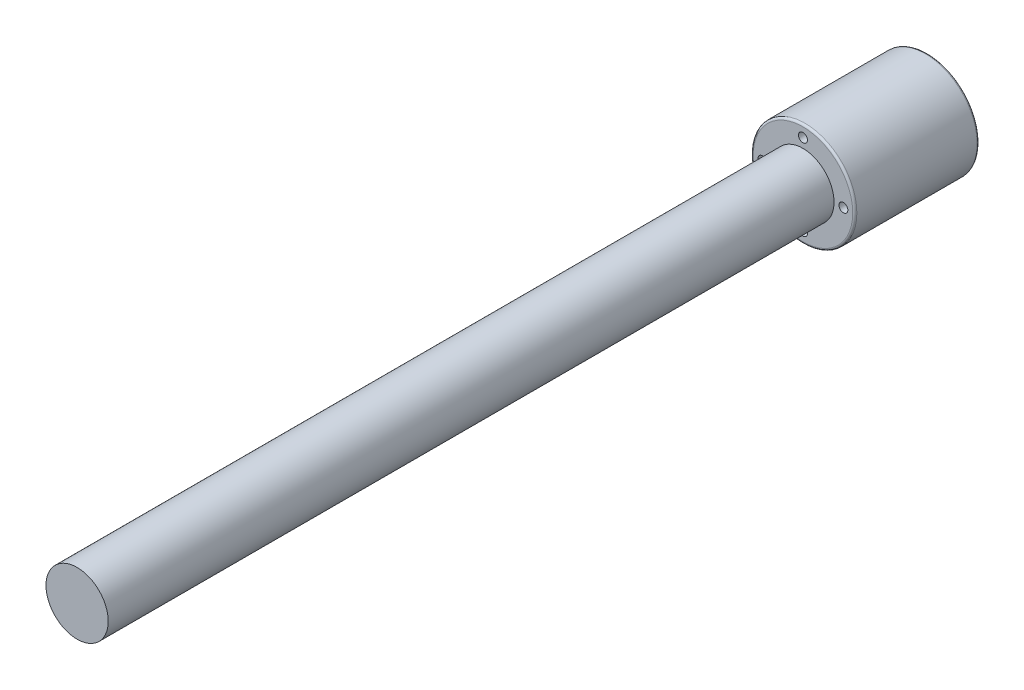
ISO-10303-21;
HEADER;
FILE_DESCRIPTION(('STEP AP214'),'2;1');
FILE_NAME('part.step','',(''),(''),'','','');
FILE_SCHEMA(('AUTOMOTIVE_DESIGN { 1 0 10303 214 1 1 1 1 }'));
ENDSEC;
DATA;
#1=APPLICATION_CONTEXT('core data for automotive mechanical design processes');
#2=APPLICATION_PROTOCOL_DEFINITION('international standard','automotive_design',2000,#1);
#3=PRODUCT_CONTEXT('',#1,'mechanical');
#4=PRODUCT('Part','Part','',(#3));
#5=PRODUCT_RELATED_PRODUCT_CATEGORY('part','',(#4));
#6=PRODUCT_DEFINITION_FORMATION('','',#4);
#7=PRODUCT_DEFINITION_CONTEXT('part definition',#1,'design');
#8=PRODUCT_DEFINITION('design','',#6,#7);
#9=PRODUCT_DEFINITION_SHAPE('','',#8);
#10=(LENGTH_UNIT() NAMED_UNIT(*) SI_UNIT(.MILLI.,.METRE.));
#11=(NAMED_UNIT(*) PLANE_ANGLE_UNIT() SI_UNIT($,.RADIAN.));
#12=(NAMED_UNIT(*) SI_UNIT($,.STERADIAN.) SOLID_ANGLE_UNIT());
#13=UNCERTAINTY_MEASURE_WITH_UNIT(LENGTH_MEASURE(1.E-05),#10,'distance_accuracy_value','');
#14=(GEOMETRIC_REPRESENTATION_CONTEXT(3) GLOBAL_UNCERTAINTY_ASSIGNED_CONTEXT((#13)) GLOBAL_UNIT_ASSIGNED_CONTEXT((#10,
#11,#12)) REPRESENTATION_CONTEXT('',''));
#15=CARTESIAN_POINT('',(0.,0.,0.));
#16=DIRECTION('',(0.,0.,1.));
#17=DIRECTION('',(1.,0.,0.));
#18=AXIS2_PLACEMENT_3D('',#15,#16,#17);
#19=CARTESIAN_POINT('',(0.,0.,0.));
#20=DIRECTION('',(0.,0.,1.));
#21=DIRECTION('',(1.,0.,0.));
#22=AXIS2_PLACEMENT_3D('',#19,#20,#21);
#23=PLANE('',#22);
#24=CARTESIAN_POINT('',(0.,0.,0.));
#25=DIRECTION('',(0.,0.,1.));
#26=DIRECTION('',(1.,0.,0.));
#27=AXIS2_PLACEMENT_3D('',#24,#25,#26);
#28=CIRCLE('',#27,15.);
#29=CARTESIAN_POINT('',(-15.,0.,0.));
#30=VERTEX_POINT('',#29);
#31=EDGE_CURVE('E10',#30,#30,#28,.T.);
#32=ORIENTED_EDGE('',*,*,#31,.T.);
#33=EDGE_LOOP('',(#32));
#34=FACE_BOUND('',#33,.T.);
#35=ADVANCED_FACE('F15',(#34),#23,.T.);
#36=CARTESIAN_POINT('',(0.,0.,0.));
#37=DIRECTION('',(0.,0.,-1.));
#38=DIRECTION('',(1.,0.,0.));
#39=AXIS2_PLACEMENT_3D('',#36,#37,#38);
#40=CYLINDRICAL_SURFACE('',#39,15.);
#41=CARTESIAN_POINT('',(0.,0.,-350.));
#42=DIRECTION('',(0.,0.,1.));
#43=DIRECTION('',(1.,0.,0.));
#44=AXIS2_PLACEMENT_3D('',#41,#42,#43);
#45=CIRCLE('',#44,15.);
#46=CARTESIAN_POINT('',(-15.,0.,-350.));
#47=VERTEX_POINT('',#46);
#48=EDGE_CURVE('E203',#47,#47,#45,.T.);
#49=ORIENTED_EDGE('',*,*,#48,.T.);
#50=DIRECTION('',(0.,0.,1.));
#51=VECTOR('',#50,1.);
#52=CARTESIAN_POINT('',(-15.,0.,0.));
#53=LINE('',#52,#51);
#54=EDGE_CURVE('E24',#47,#30,#53,.T.);
#55=ORIENTED_EDGE('',*,*,#54,.T.);
#56=ORIENTED_EDGE('',*,*,#31,.F.);
#57=ORIENTED_EDGE('',*,*,#54,.F.);
#58=EDGE_LOOP('',(#49,#55,#56,#57));
#59=FACE_BOUND('',#58,.T.);
#60=ADVANCED_FACE('F342',(#59),#40,.T.);
#61=CARTESIAN_POINT('',(0.,0.,-10.));
#62=DIRECTION('',(0.,0.,1.));
#63=DIRECTION('',(1.,0.,0.));
#64=AXIS2_PLACEMENT_3D('',#61,#62,#63);
#65=PLANE('',#64);
#66=CARTESIAN_POINT('',(0.,0.,-10.));
#67=DIRECTION('',(0.,0.,1.));
#68=DIRECTION('',(1.,0.,0.));
#69=AXIS2_PLACEMENT_3D('',#66,#67,#68);
#70=CIRCLE('',#69,5.);
#71=CARTESIAN_POINT('',(-5.,0.,-10.));
#72=VERTEX_POINT('',#71);
#73=EDGE_CURVE('E151',#72,#72,#70,.T.);
#74=ORIENTED_EDGE('',*,*,#73,.F.);
#75=EDGE_LOOP('',(#74));
#76=FACE_BOUND('',#75,.T.);
#77=ADVANCED_FACE('F17',(#76),#65,.F.);
#78=CARTESIAN_POINT('',(0.,0.,0.));
#79=DIRECTION('',(0.,0.,-1.));
#80=DIRECTION('',(1.,0.,0.));
#81=AXIS2_PLACEMENT_3D('',#78,#79,#80);
#82=CYLINDRICAL_SURFACE('',#81,5.);
#83=ORIENTED_EDGE('',*,*,#73,.T.);
#84=DIRECTION('',(0.,0.,-1.));
#85=VECTOR('',#84,1.);
#86=CARTESIAN_POINT('',(-5.,0.,0.));
#87=LINE('',#86,#85);
#88=CARTESIAN_POINT('',(-5.,0.,-360.));
#89=VERTEX_POINT('',#88);
#90=EDGE_CURVE('E41',#72,#89,#87,.T.);
#91=ORIENTED_EDGE('',*,*,#90,.T.);
#92=CARTESIAN_POINT('',(0.,0.,-360.));
#93=DIRECTION('',(0.,0.,1.));
#94=DIRECTION('',(1.,0.,0.));
#95=AXIS2_PLACEMENT_3D('',#92,#93,#94);
#96=CIRCLE('',#95,5.);
#97=EDGE_CURVE('E144',#89,#89,#96,.T.);
#98=ORIENTED_EDGE('',*,*,#97,.F.);
#99=ORIENTED_EDGE('',*,*,#90,.F.);
#100=EDGE_LOOP('',(#83,#91,#98,#99));
#101=FACE_BOUND('',#100,.T.);
#102=ADVANCED_FACE('F341',(#101),#82,.F.);
#103=CARTESIAN_POINT('',(0.,0.,-350.));
#104=DIRECTION('',(0.,0.,-1.));
#105=DIRECTION('',(-1.,0.,0.));
#106=AXIS2_PLACEMENT_3D('',#103,#104,#105);
#107=CYLINDRICAL_SURFACE('',#106,15.);
#108=CARTESIAN_POINT('',(0.,0.,-360.));
#109=DIRECTION('',(0.,0.,-1.));
#110=DIRECTION('',(-1.,0.,0.));
#111=AXIS2_PLACEMENT_3D('',#108,#109,#110);
#112=CIRCLE('',#111,15.);
#113=CARTESIAN_POINT('',(15.,0.,-360.));
#114=VERTEX_POINT('',#113);
#115=EDGE_CURVE('E140',#114,#114,#112,.T.);
#116=ORIENTED_EDGE('',*,*,#115,.F.);
#117=DIRECTION('',(0.,0.,-1.));
#118=VECTOR('',#117,1.);
#119=CARTESIAN_POINT('',(15.,0.,-350.));
#120=LINE('',#119,#118);
#121=CARTESIAN_POINT('',(15.,0.,-410.));
#122=VERTEX_POINT('',#121);
#123=EDGE_CURVE('E148',#114,#122,#120,.T.);
#124=ORIENTED_EDGE('',*,*,#123,.T.);
#125=CARTESIAN_POINT('',(0.,0.,-410.));
#126=DIRECTION('',(0.,0.,1.));
#127=DIRECTION('',(-1.,0.,0.));
#128=AXIS2_PLACEMENT_3D('',#125,#126,#127);
#129=CIRCLE('',#128,15.);
#130=EDGE_CURVE('E178',#122,#122,#129,.T.);
#131=ORIENTED_EDGE('',*,*,#130,.F.);
#132=ORIENTED_EDGE('',*,*,#123,.F.);
#133=EDGE_LOOP('',(#116,#124,#131,#132));
#134=FACE_BOUND('',#133,.T.);
#135=ADVANCED_FACE('F356',(#134),#107,.F.);
#136=CARTESIAN_POINT('',(0.,0.,-360.));
#137=DIRECTION('',(0.,0.,-1.));
#138=DIRECTION('',(0.,-1.,0.));
#139=AXIS2_PLACEMENT_3D('',#136,#137,#138);
#140=PLANE('',#139);
#141=ORIENTED_EDGE('',*,*,#97,.T.);
#142=EDGE_LOOP('',(#141));
#143=FACE_BOUND('',#142,.T.);
#144=ORIENTED_EDGE('',*,*,#115,.T.);
#145=EDGE_LOOP('',(#144));
#146=FACE_BOUND('',#145,.T.);
#147=ADVANCED_FACE('F364',(#143,#146),#140,.T.);
#148=CARTESIAN_POINT('',(0.,19.5,6.05288125429439));
#149=DIRECTION('',(0.,0.,-1.));
#150=DIRECTION('',(-1.,0.,0.));
#151=AXIS2_PLACEMENT_3D('',#148,#149,#150);
#152=CYLINDRICAL_SURFACE('',#151,2.15);
#153=CARTESIAN_POINT('',(0.,19.5,-410.));
#154=DIRECTION('',(0.,0.,1.));
#155=DIRECTION('',(-1.,0.,0.));
#156=AXIS2_PLACEMENT_3D('',#153,#154,#155);
#157=CIRCLE('',#156,2.15);
#158=CARTESIAN_POINT('',(2.15,19.5,-410.));
#159=VERTEX_POINT('',#158);
#160=EDGE_CURVE('E182',#159,#159,#157,.T.);
#161=ORIENTED_EDGE('',*,*,#160,.F.);
#162=DIRECTION('',(0.,0.,1.));
#163=VECTOR('',#162,1.);
#164=CARTESIAN_POINT('',(2.15,19.5,6.05288125429439));
#165=LINE('',#164,#163);
#166=CARTESIAN_POINT('',(2.15,19.5,-350.));
#167=VERTEX_POINT('',#166);
#168=EDGE_CURVE('E137',#159,#167,#165,.T.);
#169=ORIENTED_EDGE('',*,*,#168,.T.);
#170=CARTESIAN_POINT('',(0.,19.5,-350.));
#171=DIRECTION('',(0.,0.,-1.));
#172=DIRECTION('',(-1.,0.,0.));
#173=AXIS2_PLACEMENT_3D('',#170,#171,#172);
#174=CIRCLE('',#173,2.15);
#175=EDGE_CURVE('E205',#167,#167,#174,.T.);
#176=ORIENTED_EDGE('',*,*,#175,.F.);
#177=ORIENTED_EDGE('',*,*,#168,.F.);
#178=EDGE_LOOP('',(#161,#169,#176,#177));
#179=FACE_BOUND('',#178,.T.);
#180=ADVANCED_FACE('F370',(#179),#152,.F.);
#181=CARTESIAN_POINT('',(19.5,0.,6.05288125429439));
#182=DIRECTION('',(0.,0.,-1.));
#183=DIRECTION('',(-1.,0.,0.));
#184=AXIS2_PLACEMENT_3D('',#181,#182,#183);
#185=CYLINDRICAL_SURFACE('',#184,2.15);
#186=CARTESIAN_POINT('',(19.5,0.,-410.));
#187=DIRECTION('',(0.,0.,1.));
#188=DIRECTION('',(-1.,0.,0.));
#189=AXIS2_PLACEMENT_3D('',#186,#187,#188);
#190=CIRCLE('',#189,2.15);
#191=CARTESIAN_POINT('',(21.65,0.,-410.));
#192=VERTEX_POINT('',#191);
#193=EDGE_CURVE('E183',#192,#192,#190,.T.);
#194=ORIENTED_EDGE('',*,*,#193,.F.);
#195=DIRECTION('',(0.,0.,1.));
#196=VECTOR('',#195,1.);
#197=CARTESIAN_POINT('',(21.65,0.,6.05288125429439));
#198=LINE('',#197,#196);
#199=CARTESIAN_POINT('',(21.65,0.,-350.));
#200=VERTEX_POINT('',#199);
#201=EDGE_CURVE('E134',#192,#200,#198,.T.);
#202=ORIENTED_EDGE('',*,*,#201,.T.);
#203=CARTESIAN_POINT('',(19.5,0.,-350.));
#204=DIRECTION('',(0.,0.,-1.));
#205=DIRECTION('',(-1.,0.,0.));
#206=AXIS2_PLACEMENT_3D('',#203,#204,#205);
#207=CIRCLE('',#206,2.15);
#208=EDGE_CURVE('E127',#200,#200,#207,.T.);
#209=ORIENTED_EDGE('',*,*,#208,.F.);
#210=ORIENTED_EDGE('',*,*,#201,.F.);
#211=EDGE_LOOP('',(#194,#202,#209,#210));
#212=FACE_BOUND('',#211,.T.);
#213=ADVANCED_FACE('F218',(#212),#185,.F.);
#214=CARTESIAN_POINT('',(0.,-19.5,6.05288125429439));
#215=DIRECTION('',(0.,0.,-1.));
#216=DIRECTION('',(-1.,0.,0.));
#217=AXIS2_PLACEMENT_3D('',#214,#215,#216);
#218=CYLINDRICAL_SURFACE('',#217,2.15);
#219=CARTESIAN_POINT('',(0.,-19.5,-410.));
#220=DIRECTION('',(0.,0.,1.));
#221=DIRECTION('',(-1.,0.,0.));
#222=AXIS2_PLACEMENT_3D('',#219,#220,#221);
#223=CIRCLE('',#222,2.15);
#224=CARTESIAN_POINT('',(2.15,-19.5,-410.));
#225=VERTEX_POINT('',#224);
#226=EDGE_CURVE('E187',#225,#225,#223,.T.);
#227=ORIENTED_EDGE('',*,*,#226,.F.);
#228=DIRECTION('',(0.,0.,1.));
#229=VECTOR('',#228,1.);
#230=CARTESIAN_POINT('',(2.15,-19.5,6.05288125429439));
#231=LINE('',#230,#229);
#232=CARTESIAN_POINT('',(2.15,-19.5,-350.));
#233=VERTEX_POINT('',#232);
#234=EDGE_CURVE('E115',#225,#233,#231,.T.);
#235=ORIENTED_EDGE('',*,*,#234,.T.);
#236=CARTESIAN_POINT('',(0.,-19.5,-350.));
#237=DIRECTION('',(0.,0.,-1.));
#238=DIRECTION('',(-1.,0.,0.));
#239=AXIS2_PLACEMENT_3D('',#236,#237,#238);
#240=CIRCLE('',#239,2.15);
#241=EDGE_CURVE('E121',#233,#233,#240,.T.);
#242=ORIENTED_EDGE('',*,*,#241,.F.);
#243=ORIENTED_EDGE('',*,*,#234,.F.);
#244=EDGE_LOOP('',(#227,#235,#242,#243));
#245=FACE_BOUND('',#244,.T.);
#246=ADVANCED_FACE('F382',(#245),#218,.F.);
#247=CARTESIAN_POINT('',(-19.5,0.,6.05288125429439));
#248=DIRECTION('',(0.,0.,-1.));
#249=DIRECTION('',(-1.,0.,0.));
#250=AXIS2_PLACEMENT_3D('',#247,#248,#249);
#251=CYLINDRICAL_SURFACE('',#250,2.15);
#252=CARTESIAN_POINT('',(-19.5,0.,-410.));
#253=DIRECTION('',(0.,0.,1.));
#254=DIRECTION('',(-1.,0.,0.));
#255=AXIS2_PLACEMENT_3D('',#252,#253,#254);
#256=CIRCLE('',#255,2.15);
#257=CARTESIAN_POINT('',(-17.35,0.,-410.));
#258=VERTEX_POINT('',#257);
#259=EDGE_CURVE('E113',#258,#258,#256,.T.);
#260=ORIENTED_EDGE('',*,*,#259,.F.);
#261=DIRECTION('',(0.,0.,1.));
#262=VECTOR('',#261,1.);
#263=CARTESIAN_POINT('',(-17.35,0.,6.05288125429439));
#264=LINE('',#263,#262);
#265=CARTESIAN_POINT('',(-17.35,0.,-350.));
#266=VERTEX_POINT('',#265);
#267=EDGE_CURVE('E108',#258,#266,#264,.T.);
#268=ORIENTED_EDGE('',*,*,#267,.T.);
#269=CARTESIAN_POINT('',(-19.5,0.,-350.));
#270=DIRECTION('',(0.,0.,-1.));
#271=DIRECTION('',(-1.,0.,0.));
#272=AXIS2_PLACEMENT_3D('',#269,#270,#271);
#273=CIRCLE('',#272,2.15);
#274=EDGE_CURVE('E111',#266,#266,#273,.T.);
#275=ORIENTED_EDGE('',*,*,#274,.F.);
#276=ORIENTED_EDGE('',*,*,#267,.F.);
#277=EDGE_LOOP('',(#260,#268,#275,#276));
#278=FACE_BOUND('',#277,.T.);
#279=ADVANCED_FACE('F110',(#278),#251,.F.);
#280=CARTESIAN_POINT('',(0.,0.,-350.));
#281=DIRECTION('',(0.,0.,-1.));
#282=DIRECTION('',(0.,-1.,0.));
#283=AXIS2_PLACEMENT_3D('',#280,#281,#282);
#284=PLANE('',#283);
#285=ORIENTED_EDGE('',*,*,#274,.T.);
#286=EDGE_LOOP('',(#285));
#287=FACE_BOUND('',#286,.T.);
#288=ORIENTED_EDGE('',*,*,#241,.T.);
#289=EDGE_LOOP('',(#288));
#290=FACE_BOUND('',#289,.T.);
#291=ORIENTED_EDGE('',*,*,#208,.T.);
#292=EDGE_LOOP('',(#291));
#293=FACE_BOUND('',#292,.T.);
#294=ORIENTED_EDGE('',*,*,#175,.T.);
#295=EDGE_LOOP('',(#294));
#296=FACE_BOUND('',#295,.T.);
#297=ORIENTED_EDGE('',*,*,#48,.F.);
#298=EDGE_LOOP('',(#297));
#299=FACE_BOUND('',#298,.T.);
#300=CARTESIAN_POINT('',(0.,0.,-350.));
#301=DIRECTION('',(0.,0.,-1.));
#302=DIRECTION('',(1.,0.,0.));
#303=AXIS2_PLACEMENT_3D('',#300,#301,#302);
#304=CIRCLE('',#303,24.);
#305=CARTESIAN_POINT('',(24.,0.,-350.));
#306=VERTEX_POINT('',#305);
#307=EDGE_CURVE('E200',#306,#306,#304,.T.);
#308=ORIENTED_EDGE('',*,*,#307,.F.);
#309=EDGE_LOOP('',(#308));
#310=FACE_BOUND('',#309,.T.);
#311=ADVANCED_FACE('F118',(#287,#290,#293,#296,#299,#310),#284,.F.);
#312=CARTESIAN_POINT('',(0.,0.,-351.));
#313=DIRECTION('',(0.,0.,-1.));
#314=DIRECTION('',(-1.,0.,0.));
#315=AXIS2_PLACEMENT_3D('',#312,#313,#314);
#316=TOROIDAL_SURFACE('',#315,24.,1.);
#317=CARTESIAN_POINT('',(0.,0.,-351.));
#318=DIRECTION('',(0.,0.,1.));
#319=DIRECTION('',(1.,0.,0.));
#320=AXIS2_PLACEMENT_3D('',#317,#318,#319);
#321=CIRCLE('',#320,25.);
#322=CARTESIAN_POINT('',(25.,0.,-351.));
#323=VERTEX_POINT('',#322);
#324=EDGE_CURVE('E174',#323,#323,#321,.T.);
#325=ORIENTED_EDGE('',*,*,#324,.T.);
#326=CARTESIAN_POINT('',(24.,0.,-351.));
#327=DIRECTION('',(0.,-1.,0.));
#328=DIRECTION('',(1.,0.,0.));
#329=AXIS2_PLACEMENT_3D('',#326,#327,#328);
#330=CIRCLE('',#329,1.);
#331=EDGE_CURVE('E196',#323,#306,#330,.T.);
#332=ORIENTED_EDGE('',*,*,#331,.T.);
#333=ORIENTED_EDGE('',*,*,#307,.T.);
#334=ORIENTED_EDGE('',*,*,#331,.F.);
#335=EDGE_LOOP('',(#325,#332,#333,#334));
#336=FACE_BOUND('',#335,.T.);
#337=ADVANCED_FACE('F224',(#336),#316,.T.);
#338=CARTESIAN_POINT('',(0.,0.,-410.));
#339=DIRECTION('',(0.,0.,-1.));
#340=DIRECTION('',(0.,-1.,0.));
#341=AXIS2_PLACEMENT_3D('',#338,#339,#340);
#342=PLANE('',#341);
#343=ORIENTED_EDGE('',*,*,#259,.T.);
#344=EDGE_LOOP('',(#343));
#345=FACE_BOUND('',#344,.T.);
#346=ORIENTED_EDGE('',*,*,#226,.T.);
#347=EDGE_LOOP('',(#346));
#348=FACE_BOUND('',#347,.T.);
#349=ORIENTED_EDGE('',*,*,#193,.T.);
#350=EDGE_LOOP('',(#349));
#351=FACE_BOUND('',#350,.T.);
#352=ORIENTED_EDGE('',*,*,#160,.T.);
#353=EDGE_LOOP('',(#352));
#354=FACE_BOUND('',#353,.T.);
#355=ORIENTED_EDGE('',*,*,#130,.T.);
#356=EDGE_LOOP('',(#355));
#357=FACE_BOUND('',#356,.T.);
#358=CARTESIAN_POINT('',(0.,0.,-410.));
#359=DIRECTION('',(0.,0.,1.));
#360=DIRECTION('',(1.,0.,0.));
#361=AXIS2_PLACEMENT_3D('',#358,#359,#360);
#362=CIRCLE('',#361,24.);
#363=CARTESIAN_POINT('',(24.,0.,-410.));
#364=VERTEX_POINT('',#363);
#365=EDGE_CURVE('E170',#364,#364,#362,.T.);
#366=ORIENTED_EDGE('',*,*,#365,.F.);
#367=EDGE_LOOP('',(#366));
#368=FACE_BOUND('',#367,.T.);
#369=ADVANCED_FACE('F220',(#345,#348,#351,#354,#357,#368),#342,.T.);
#370=CARTESIAN_POINT('',(0.,0.,-350.));
#371=DIRECTION('',(0.,0.,-1.));
#372=DIRECTION('',(-1.,0.,0.));
#373=AXIS2_PLACEMENT_3D('',#370,#371,#372);
#374=CYLINDRICAL_SURFACE('',#373,25.);
#375=CARTESIAN_POINT('',(0.,0.,-409.));
#376=DIRECTION('',(0.,0.,-1.));
#377=DIRECTION('',(1.,0.,0.));
#378=AXIS2_PLACEMENT_3D('',#375,#376,#377);
#379=CIRCLE('',#378,25.);
#380=CARTESIAN_POINT('',(25.,0.,-409.));
#381=VERTEX_POINT('',#380);
#382=EDGE_CURVE('E169',#381,#381,#379,.T.);
#383=ORIENTED_EDGE('',*,*,#382,.F.);
#384=DIRECTION('',(0.,0.,1.));
#385=VECTOR('',#384,1.);
#386=CARTESIAN_POINT('',(25.,0.,-350.));
#387=LINE('',#386,#385);
#388=EDGE_CURVE('E163',#381,#323,#387,.T.);
#389=ORIENTED_EDGE('',*,*,#388,.T.);
#390=ORIENTED_EDGE('',*,*,#324,.F.);
#391=ORIENTED_EDGE('',*,*,#388,.F.);
#392=EDGE_LOOP('',(#383,#389,#390,#391));
#393=FACE_BOUND('',#392,.T.);
#394=ADVANCED_FACE('F223',(#393),#374,.T.);
#395=CARTESIAN_POINT('',(0.,0.,-409.));
#396=DIRECTION('',(0.,0.,-1.));
#397=DIRECTION('',(-1.,0.,0.));
#398=AXIS2_PLACEMENT_3D('',#395,#396,#397);
#399=TOROIDAL_SURFACE('',#398,24.,1.);
#400=ORIENTED_EDGE('',*,*,#365,.T.);
#401=CARTESIAN_POINT('',(24.,0.,-409.));
#402=DIRECTION('',(0.,-1.,0.));
#403=DIRECTION('',(1.,0.,0.));
#404=AXIS2_PLACEMENT_3D('',#401,#402,#403);
#405=CIRCLE('',#404,1.);
#406=EDGE_CURVE('E165',#364,#381,#405,.T.);
#407=ORIENTED_EDGE('',*,*,#406,.T.);
#408=ORIENTED_EDGE('',*,*,#382,.T.);
#409=ORIENTED_EDGE('',*,*,#406,.F.);
#410=EDGE_LOOP('',(#400,#407,#408,#409));
#411=FACE_BOUND('',#410,.T.);
#412=ADVANCED_FACE('F433',(#411),#399,.T.);
#413=CLOSED_SHELL('',(#35,#60,#77,#102,#135,#147,#180,#213,#246,#279,#311,#337,#369,#394,#412));
#414=MANIFOLD_SOLID_BREP('B1',#413);
#415=ADVANCED_BREP_SHAPE_REPRESENTATION('',(#18,#414),#14);
#416=SHAPE_DEFINITION_REPRESENTATION(#9,#415);
ENDSEC;
END-ISO-10303-21;
